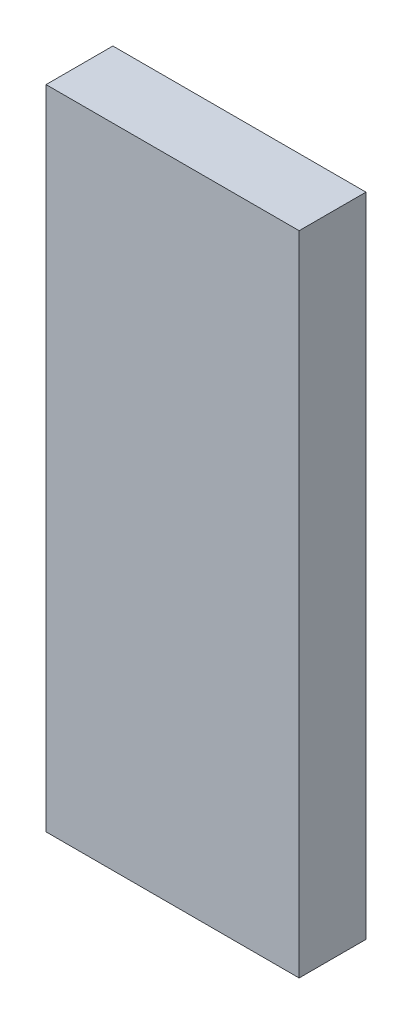
ISO-10303-21;
HEADER;
FILE_DESCRIPTION(('STEP AP214'),'2;1');
FILE_NAME('part.step','',(''),(''),'','','');
FILE_SCHEMA(('AUTOMOTIVE_DESIGN { 1 0 10303 214 1 1 1 1 }'));
ENDSEC;
DATA;
#1=APPLICATION_CONTEXT('core data for automotive mechanical design processes');
#2=APPLICATION_PROTOCOL_DEFINITION('international standard','automotive_design',2000,#1);
#3=PRODUCT_CONTEXT('',#1,'mechanical');
#4=PRODUCT('Part','Part','',(#3));
#5=PRODUCT_RELATED_PRODUCT_CATEGORY('part','',(#4));
#6=PRODUCT_DEFINITION_FORMATION('','',#4);
#7=PRODUCT_DEFINITION_CONTEXT('part definition',#1,'design');
#8=PRODUCT_DEFINITION('design','',#6,#7);
#9=PRODUCT_DEFINITION_SHAPE('','',#8);
#10=(LENGTH_UNIT() NAMED_UNIT(*) SI_UNIT(.MILLI.,.METRE.));
#11=(NAMED_UNIT(*) PLANE_ANGLE_UNIT() SI_UNIT($,.RADIAN.));
#12=(NAMED_UNIT(*) SI_UNIT($,.STERADIAN.) SOLID_ANGLE_UNIT());
#13=UNCERTAINTY_MEASURE_WITH_UNIT(LENGTH_MEASURE(1.E-05),#10,'distance_accuracy_value','');
#14=(GEOMETRIC_REPRESENTATION_CONTEXT(3) GLOBAL_UNCERTAINTY_ASSIGNED_CONTEXT((#13)) GLOBAL_UNIT_ASSIGNED_CONTEXT((#10,
#11,#12)) REPRESENTATION_CONTEXT('',''));
#15=CARTESIAN_POINT('',(0.,0.,0.));
#16=DIRECTION('',(0.,0.,1.));
#17=DIRECTION('',(1.,0.,0.));
#18=AXIS2_PLACEMENT_3D('',#15,#16,#17);
#19=CARTESIAN_POINT('',(0.62500002,1.59826706,0.32999934));
#20=DIRECTION('',(0.,0.,1.));
#21=DIRECTION('',(1.,0.,0.));
#22=AXIS2_PLACEMENT_3D('',#19,#20,#21);
#23=PLANE('',#22);
#24=DIRECTION('',(1.,0.,0.));
#25=VECTOR('',#24,1.);
#26=CARTESIAN_POINT('',(-0.62500002,1.59826706,0.32999934));
#27=LINE('',#26,#25);
#28=CARTESIAN_POINT('',(-0.62500002,1.59826706,0.32999934));
#29=VERTEX_POINT('',#28);
#30=CARTESIAN_POINT('',(0.62500002,1.59826706,0.32999934));
#31=VERTEX_POINT('',#30);
#32=EDGE_CURVE('E27',#29,#31,#27,.T.);
#33=ORIENTED_EDGE('',*,*,#32,.F.);
#34=DIRECTION('',(0.,1.,0.));
#35=VECTOR('',#34,1.);
#36=CARTESIAN_POINT('',(-0.62500002,-1.59826452,0.32999934));
#37=LINE('',#36,#35);
#38=CARTESIAN_POINT('',(-0.62500002,-1.59826452,0.32999934));
#39=VERTEX_POINT('',#38);
#40=EDGE_CURVE('E91',#39,#29,#37,.T.);
#41=ORIENTED_EDGE('',*,*,#40,.F.);
#42=DIRECTION('',(-1.,0.,0.));
#43=VECTOR('',#42,1.);
#44=CARTESIAN_POINT('',(0.62500002,-1.59826452,0.32999934));
#45=LINE('',#44,#43);
#46=CARTESIAN_POINT('',(0.62500002,-1.59826452,0.32999934));
#47=VERTEX_POINT('',#46);
#48=EDGE_CURVE('E20',#47,#39,#45,.T.);
#49=ORIENTED_EDGE('',*,*,#48,.F.);
#50=DIRECTION('',(0.,-1.,0.));
#51=VECTOR('',#50,1.);
#52=CARTESIAN_POINT('',(0.62500002,1.59826706,0.32999934));
#53=LINE('',#52,#51);
#54=EDGE_CURVE('E75',#31,#47,#53,.T.);
#55=ORIENTED_EDGE('',*,*,#54,.F.);
#56=EDGE_LOOP('',(#33,#41,#49,#55));
#57=FACE_BOUND('',#56,.T.);
#58=ADVANCED_FACE('F16',(#57),#23,.T.);
#59=CARTESIAN_POINT('',(0.62500002,1.59826706,0.));
#60=DIRECTION('',(0.,0.,1.));
#61=DIRECTION('',(1.,0.,0.));
#62=AXIS2_PLACEMENT_3D('',#59,#60,#61);
#63=PLANE('',#62);
#64=DIRECTION('',(0.,-1.,0.));
#65=VECTOR('',#64,1.);
#66=CARTESIAN_POINT('',(0.62500002,1.59826706,0.));
#67=LINE('',#66,#65);
#68=CARTESIAN_POINT('',(0.62500002,1.59826706,0.));
#69=VERTEX_POINT('',#68);
#70=CARTESIAN_POINT('',(0.62500002,-1.59826452,0.));
#71=VERTEX_POINT('',#70);
#72=EDGE_CURVE('E83',#69,#71,#67,.T.);
#73=ORIENTED_EDGE('',*,*,#72,.T.);
#74=DIRECTION('',(-1.,0.,0.));
#75=VECTOR('',#74,1.);
#76=CARTESIAN_POINT('',(0.62500002,-1.59826452,0.));
#77=LINE('',#76,#75);
#78=CARTESIAN_POINT('',(-0.62500002,-1.59826452,0.));
#79=VERTEX_POINT('',#78);
#80=EDGE_CURVE('E94',#71,#79,#77,.T.);
#81=ORIENTED_EDGE('',*,*,#80,.T.);
#82=DIRECTION('',(0.,1.,0.));
#83=VECTOR('',#82,1.);
#84=CARTESIAN_POINT('',(-0.62500002,-1.59826452,0.));
#85=LINE('',#84,#83);
#86=CARTESIAN_POINT('',(-0.62500002,1.59826706,0.));
#87=VERTEX_POINT('',#86);
#88=EDGE_CURVE('E72',#79,#87,#85,.T.);
#89=ORIENTED_EDGE('',*,*,#88,.T.);
#90=DIRECTION('',(1.,0.,0.));
#91=VECTOR('',#90,1.);
#92=CARTESIAN_POINT('',(-0.62500002,1.59826706,0.));
#93=LINE('',#92,#91);
#94=EDGE_CURVE('E10',#87,#69,#93,.T.);
#95=ORIENTED_EDGE('',*,*,#94,.T.);
#96=EDGE_LOOP('',(#73,#81,#89,#95));
#97=FACE_BOUND('',#96,.T.);
#98=ADVANCED_FACE('F124',(#97),#63,.F.);
#99=CARTESIAN_POINT('',(-0.62500002,1.59826706,0.));
#100=DIRECTION('',(0.,1.,0.));
#101=DIRECTION('',(1.,0.,0.));
#102=AXIS2_PLACEMENT_3D('',#99,#100,#101);
#103=PLANE('',#102);
#104=DIRECTION('',(0.,0.,1.));
#105=VECTOR('',#104,1.);
#106=CARTESIAN_POINT('',(-0.62500002,1.59826706,0.));
#107=LINE('',#106,#105);
#108=EDGE_CURVE('E69',#87,#29,#107,.T.);
#109=ORIENTED_EDGE('',*,*,#108,.T.);
#110=ORIENTED_EDGE('',*,*,#32,.T.);
#111=DIRECTION('',(0.,0.,1.));
#112=VECTOR('',#111,1.);
#113=CARTESIAN_POINT('',(0.62500002,1.59826706,0.));
#114=LINE('',#113,#112);
#115=EDGE_CURVE('E67',#69,#31,#114,.T.);
#116=ORIENTED_EDGE('',*,*,#115,.F.);
#117=ORIENTED_EDGE('',*,*,#94,.F.);
#118=EDGE_LOOP('',(#109,#110,#116,#117));
#119=FACE_BOUND('',#118,.T.);
#120=ADVANCED_FACE('F65',(#119),#103,.T.);
#121=CARTESIAN_POINT('',(-0.62500002,-1.59826452,0.));
#122=DIRECTION('',(-1.,0.,0.));
#123=DIRECTION('',(0.,0.,1.));
#124=AXIS2_PLACEMENT_3D('',#121,#122,#123);
#125=PLANE('',#124);
#126=DIRECTION('',(0.,0.,1.));
#127=VECTOR('',#126,1.);
#128=CARTESIAN_POINT('',(-0.62500002,-1.59826452,0.));
#129=LINE('',#128,#127);
#130=EDGE_CURVE('E101',#79,#39,#129,.T.);
#131=ORIENTED_EDGE('',*,*,#130,.T.);
#132=ORIENTED_EDGE('',*,*,#40,.T.);
#133=ORIENTED_EDGE('',*,*,#108,.F.);
#134=ORIENTED_EDGE('',*,*,#88,.F.);
#135=EDGE_LOOP('',(#131,#132,#133,#134));
#136=FACE_BOUND('',#135,.T.);
#137=ADVANCED_FACE('F18',(#136),#125,.T.);
#138=CARTESIAN_POINT('',(0.62500002,-1.59826452,0.));
#139=DIRECTION('',(0.,-1.,0.));
#140=DIRECTION('',(0.,0.,-1.));
#141=AXIS2_PLACEMENT_3D('',#138,#139,#140);
#142=PLANE('',#141);
#143=DIRECTION('',(0.,0.,1.));
#144=VECTOR('',#143,1.);
#145=CARTESIAN_POINT('',(0.62500002,-1.59826452,0.));
#146=LINE('',#145,#144);
#147=EDGE_CURVE('E79',#71,#47,#146,.T.);
#148=ORIENTED_EDGE('',*,*,#147,.T.);
#149=ORIENTED_EDGE('',*,*,#48,.T.);
#150=ORIENTED_EDGE('',*,*,#130,.F.);
#151=ORIENTED_EDGE('',*,*,#80,.F.);
#152=EDGE_LOOP('',(#148,#149,#150,#151));
#153=FACE_BOUND('',#152,.T.);
#154=ADVANCED_FACE('F116',(#153),#142,.T.);
#155=CARTESIAN_POINT('',(0.62500002,1.59826706,0.));
#156=DIRECTION('',(1.,0.,0.));
#157=DIRECTION('',(0.,1.,0.));
#158=AXIS2_PLACEMENT_3D('',#155,#156,#157);
#159=PLANE('',#158);
#160=ORIENTED_EDGE('',*,*,#115,.T.);
#161=ORIENTED_EDGE('',*,*,#54,.T.);
#162=ORIENTED_EDGE('',*,*,#147,.F.);
#163=ORIENTED_EDGE('',*,*,#72,.F.);
#164=EDGE_LOOP('',(#160,#161,#162,#163));
#165=FACE_BOUND('',#164,.T.);
#166=ADVANCED_FACE('F81',(#165),#159,.T.);
#167=CLOSED_SHELL('',(#58,#98,#120,#137,#154,#166));
#168=MANIFOLD_SOLID_BREP('B1',#167);
#169=ADVANCED_BREP_SHAPE_REPRESENTATION('',(#18,#168),#14);
#170=SHAPE_DEFINITION_REPRESENTATION(#9,#169);
ENDSEC;
END-ISO-10303-21;
